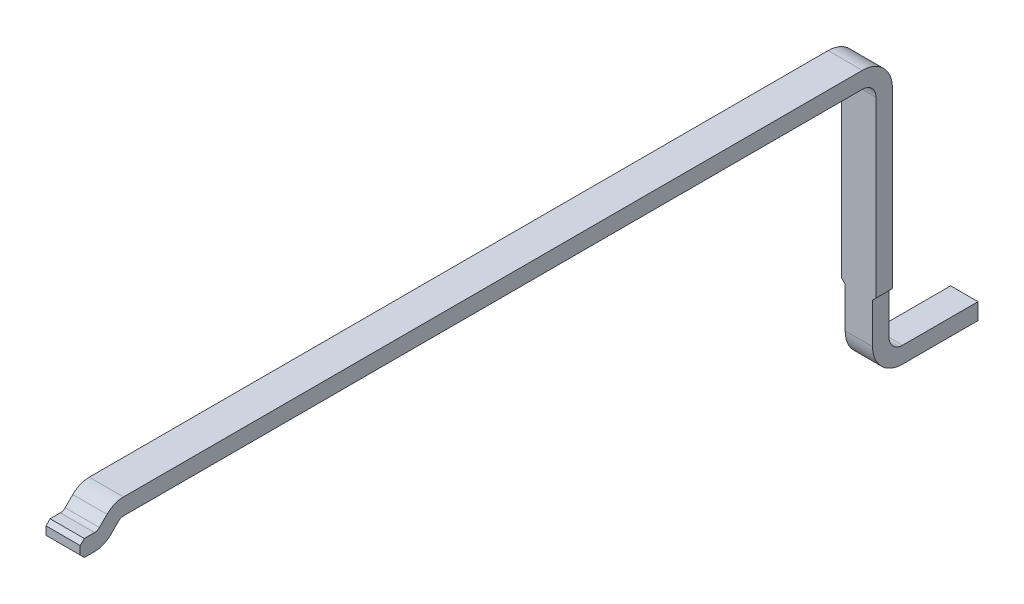
ISO-10303-21;
HEADER;
FILE_DESCRIPTION(('STEP AP214'),'2;1');
FILE_NAME('part.step','',(''),(''),'','','');
FILE_SCHEMA(('AUTOMOTIVE_DESIGN { 1 0 10303 214 1 1 1 1 }'));
ENDSEC;
DATA;
#1=APPLICATION_CONTEXT('core data for automotive mechanical design processes');
#2=APPLICATION_PROTOCOL_DEFINITION('international standard','automotive_design',2000,#1);
#3=PRODUCT_CONTEXT('',#1,'mechanical');
#4=PRODUCT('Part','Part','',(#3));
#5=PRODUCT_RELATED_PRODUCT_CATEGORY('part','',(#4));
#6=PRODUCT_DEFINITION_FORMATION('','',#4);
#7=PRODUCT_DEFINITION_CONTEXT('part definition',#1,'design');
#8=PRODUCT_DEFINITION('design','',#6,#7);
#9=PRODUCT_DEFINITION_SHAPE('','',#8);
#10=(LENGTH_UNIT() NAMED_UNIT(*) SI_UNIT(.MILLI.,.METRE.));
#11=(NAMED_UNIT(*) PLANE_ANGLE_UNIT() SI_UNIT($,.RADIAN.));
#12=(NAMED_UNIT(*) SI_UNIT($,.STERADIAN.) SOLID_ANGLE_UNIT());
#13=UNCERTAINTY_MEASURE_WITH_UNIT(LENGTH_MEASURE(1.E-05),#10,'distance_accuracy_value','');
#14=(GEOMETRIC_REPRESENTATION_CONTEXT(3) GLOBAL_UNCERTAINTY_ASSIGNED_CONTEXT((#13)) GLOBAL_UNIT_ASSIGNED_CONTEXT((#10,
#11,#12)) REPRESENTATION_CONTEXT('',''));
#15=CARTESIAN_POINT('',(0.,0.,0.));
#16=DIRECTION('',(0.,0.,1.));
#17=DIRECTION('',(1.,0.,0.));
#18=AXIS2_PLACEMENT_3D('',#15,#16,#17);
#19=CARTESIAN_POINT('',(12.5121082047,13.39951558355,-11.38169883308));
#20=DIRECTION('',(0.,1.,0.));
#21=DIRECTION('',(1.,0.,0.));
#22=AXIS2_PLACEMENT_3D('',#19,#20,#21);
#23=PLANE('',#22);
#24=DIRECTION('',(0.,0.,-1.));
#25=VECTOR('',#24,1.);
#26=CARTESIAN_POINT('',(16.41210823521,13.39951558355,-12.98169883308));
#27=LINE('',#26,#25);
#28=CARTESIAN_POINT('',(16.41210823521,13.39951558355,-5.777115138679));
#29=VERTEX_POINT('',#28);
#30=CARTESIAN_POINT('',(16.41210823521,13.39951558355,-11.17169883308));
#31=VERTEX_POINT('',#30);
#32=EDGE_CURVE('E243',#29,#31,#27,.T.);
#33=ORIENTED_EDGE('',*,*,#32,.F.);
#34=DIRECTION('',(1.,0.,0.));
#35=VECTOR('',#34,1.);
#36=CARTESIAN_POINT('',(12.5121082047,13.39951558355,-5.777115138679));
#37=LINE('',#36,#35);
#38=CARTESIAN_POINT('',(16.16210823521,13.39951558355,-5.777115138679));
#39=VERTEX_POINT('',#38);
#40=EDGE_CURVE('E386',#39,#29,#37,.T.);
#41=ORIENTED_EDGE('',*,*,#40,.F.);
#42=DIRECTION('',(0.,0.,1.));
#43=VECTOR('',#42,1.);
#44=CARTESIAN_POINT('',(16.16210823521,13.39951558355,-5.731698833076));
#45=LINE('',#44,#43);
#46=CARTESIAN_POINT('',(16.16210823521,13.39951558355,-11.17169883308));
#47=VERTEX_POINT('',#46);
#48=EDGE_CURVE('E233',#47,#39,#45,.T.);
#49=ORIENTED_EDGE('',*,*,#48,.F.);
#50=DIRECTION('',(1.,0.,0.));
#51=VECTOR('',#50,1.);
#52=CARTESIAN_POINT('',(13.11210817501,13.39951558355,-11.17169883308));
#53=LINE('',#52,#51);
#54=EDGE_CURVE('E391',#47,#31,#53,.T.);
#55=ORIENTED_EDGE('',*,*,#54,.T.);
#56=EDGE_LOOP('',(#33,#41,#49,#55));
#57=FACE_BOUND('',#56,.T.);
#58=ADVANCED_FACE('F17',(#57),#23,.F.);
#59=CARTESIAN_POINT('',(13.0621082047,13.51951558355,-7.369063364689));
#60=DIRECTION('',(0.,1.,0.));
#61=DIRECTION('',(1.,0.,0.));
#62=AXIS2_PLACEMENT_3D('',#59,#60,#61);
#63=PLANE('',#62);
#64=DIRECTION('',(-1.,0.,0.));
#65=VECTOR('',#64,1.);
#66=CARTESIAN_POINT('',(13.0621082047,13.51951558355,-11.17169883308));
#67=LINE('',#66,#65);
#68=CARTESIAN_POINT('',(16.41210823521,13.51951558355,-11.17169883308));
#69=VERTEX_POINT('',#68);
#70=CARTESIAN_POINT('',(16.16210823521,13.51951558355,-11.17169883308));
#71=VERTEX_POINT('',#70);
#72=EDGE_CURVE('E28',#69,#71,#67,.T.);
#73=ORIENTED_EDGE('',*,*,#72,.T.);
#74=DIRECTION('',(0.,0.,1.));
#75=VECTOR('',#74,1.);
#76=CARTESIAN_POINT('',(16.16210823521,13.51951558355,-7.369063364689));
#77=LINE('',#76,#75);
#78=CARTESIAN_POINT('',(16.16210823521,13.51951558355,-5.777115138679));
#79=VERTEX_POINT('',#78);
#80=EDGE_CURVE('E286',#71,#79,#77,.T.);
#81=ORIENTED_EDGE('',*,*,#80,.T.);
#82=DIRECTION('',(1.,0.,0.));
#83=VECTOR('',#82,1.);
#84=CARTESIAN_POINT('',(13.0621082047,13.51951558355,-5.777115138679));
#85=LINE('',#84,#83);
#86=CARTESIAN_POINT('',(16.41210823521,13.51951558355,-5.777115138679));
#87=VERTEX_POINT('',#86);
#88=EDGE_CURVE('E11',#79,#87,#85,.T.);
#89=ORIENTED_EDGE('',*,*,#88,.T.);
#90=DIRECTION('',(0.,0.,-1.));
#91=VECTOR('',#90,1.);
#92=CARTESIAN_POINT('',(16.41210823521,13.51951558355,-7.369063364689));
#93=LINE('',#92,#91);
#94=EDGE_CURVE('E417',#87,#69,#93,.T.);
#95=ORIENTED_EDGE('',*,*,#94,.T.);
#96=EDGE_LOOP('',(#73,#81,#89,#95));
#97=FACE_BOUND('',#96,.T.);
#98=ADVANCED_FACE('F672',(#97),#63,.T.);
#99=CARTESIAN_POINT('',(13.0621082047,13.34951558355,-5.777115138679));
#100=DIRECTION('',(-1.,0.,0.));
#101=DIRECTION('',(0.,0.,-1.));
#102=AXIS2_PLACEMENT_3D('',#99,#100,#101);
#103=CYLINDRICAL_SURFACE('',#102,0.17);
#104=ORIENTED_EDGE('',*,*,#88,.F.);
#105=CARTESIAN_POINT('',(16.16210823521,13.34951558355,-5.777115138679));
#106=DIRECTION('',(1.,0.,0.));
#107=DIRECTION('',(0.,0.,-1.));
#108=AXIS2_PLACEMENT_3D('',#105,#106,#107);
#109=CIRCLE('',#108,0.17);
#110=CARTESIAN_POINT('',(16.16210823521,13.469723736351,-5.656906985878));
#111=VERTEX_POINT('',#110);
#112=EDGE_CURVE('E282',#79,#111,#109,.T.);
#113=ORIENTED_EDGE('',*,*,#112,.T.);
#114=DIRECTION('',(1.,0.,0.));
#115=VECTOR('',#114,1.);
#116=CARTESIAN_POINT('',(13.0621082047,13.469723736351,-5.656906985877));
#117=LINE('',#116,#115);
#118=CARTESIAN_POINT('',(16.41210823521,13.469723736351,-5.656906985878));
#119=VERTEX_POINT('',#118);
#120=EDGE_CURVE('E344',#111,#119,#117,.T.);
#121=ORIENTED_EDGE('',*,*,#120,.T.);
#122=CARTESIAN_POINT('',(16.41210823521,13.34951558355,-5.777115138679));
#123=DIRECTION('',(1.,0.,0.));
#124=DIRECTION('',(0.,0.,-1.));
#125=AXIS2_PLACEMENT_3D('',#122,#123,#124);
#126=CIRCLE('',#125,0.17);
#127=EDGE_CURVE('E403',#87,#119,#126,.T.);
#128=ORIENTED_EDGE('',*,*,#127,.F.);
#129=EDGE_LOOP('',(#104,#113,#121,#128));
#130=FACE_BOUND('',#129,.T.);
#131=ADVANCED_FACE('F677',(#130),#103,.T.);
#132=CARTESIAN_POINT('',(13.1121082047,13.29951558355,-11.17169883308));
#133=DIRECTION('',(1.,0.,0.));
#134=DIRECTION('',(0.,0.,1.));
#135=AXIS2_PLACEMENT_3D('',#132,#133,#134);
#136=CYLINDRICAL_SURFACE('',#135,0.22);
#137=ORIENTED_EDGE('',*,*,#72,.F.);
#138=CARTESIAN_POINT('',(16.41210823521,13.29951558355,-11.17169883308));
#139=DIRECTION('',(-1.,0.,0.));
#140=DIRECTION('',(0.,0.,1.));
#141=AXIS2_PLACEMENT_3D('',#138,#139,#140);
#142=CIRCLE('',#141,0.22);
#143=CARTESIAN_POINT('',(16.41210823521,13.29951558355,-11.39169883308));
#144=VERTEX_POINT('',#143);
#145=EDGE_CURVE('E325',#69,#144,#142,.T.);
#146=ORIENTED_EDGE('',*,*,#145,.T.);
#147=DIRECTION('',(-1.,0.,0.));
#148=VECTOR('',#147,1.);
#149=CARTESIAN_POINT('',(13.1121082047,13.29951558355,-11.39169883308));
#150=LINE('',#149,#148);
#151=CARTESIAN_POINT('',(16.16210823521,13.29951558355,-11.39169883308));
#152=VERTEX_POINT('',#151);
#153=EDGE_CURVE('E291',#144,#152,#150,.T.);
#154=ORIENTED_EDGE('',*,*,#153,.T.);
#155=CARTESIAN_POINT('',(16.16210823521,13.29951558355,-11.17169883308));
#156=DIRECTION('',(1.,0.,0.));
#157=DIRECTION('',(0.,0.,1.));
#158=AXIS2_PLACEMENT_3D('',#155,#156,#157);
#159=CIRCLE('',#158,0.22);
#160=EDGE_CURVE('E326',#152,#71,#159,.T.);
#161=ORIENTED_EDGE('',*,*,#160,.T.);
#162=EDGE_LOOP('',(#137,#146,#154,#161));
#163=FACE_BOUND('',#162,.T.);
#164=ADVANCED_FACE('F646',(#163),#136,.T.);
#165=CARTESIAN_POINT('',(16.91210823377,13.39951558355,-5.586698833076));
#166=DIRECTION('',(0.,0.707106781186048,0.707106781187048));
#167=DIRECTION('',(1.,0.,0.));
#168=AXIS2_PLACEMENT_3D('',#165,#166,#167);
#169=PLANE('',#168);
#170=DIRECTION('',(1.,0.,0.));
#171=VECTOR('',#170,1.);
#172=CARTESIAN_POINT('',(16.91210823377,13.414160244491,-5.601343494016));
#173=LINE('',#172,#171);
#174=CARTESIAN_POINT('',(16.16210823521,13.41416024449,-5.601343494017));
#175=VERTEX_POINT('',#174);
#176=CARTESIAN_POINT('',(16.41210823521,13.41416024449,-5.601343494017));
#177=VERTEX_POINT('',#176);
#178=EDGE_CURVE('E341',#175,#177,#173,.T.);
#179=ORIENTED_EDGE('',*,*,#178,.T.);
#180=DIRECTION('',(0.,-0.707106781180048,0.707106781193047));
#181=VECTOR('',#180,1.);
#182=CARTESIAN_POINT('',(16.41210823521,13.46972373635,-5.656906985878));
#183=LINE('',#182,#181);
#184=EDGE_CURVE('E334',#119,#177,#183,.T.);
#185=ORIENTED_EDGE('',*,*,#184,.F.);
#186=ORIENTED_EDGE('',*,*,#120,.F.);
#187=DIRECTION('',(0.,-0.707106781180048,0.707106781193047));
#188=VECTOR('',#187,1.);
#189=CARTESIAN_POINT('',(16.16210823521,13.46972373635,-5.656906985878));
#190=LINE('',#189,#188);
#191=EDGE_CURVE('E287',#111,#175,#190,.T.);
#192=ORIENTED_EDGE('',*,*,#191,.T.);
#193=EDGE_LOOP('',(#179,#185,#186,#192));
#194=FACE_BOUND('',#193,.T.);
#195=ADVANCED_FACE('F640',(#194),#169,.T.);
#196=CARTESIAN_POINT('',(16.91210823377,13.44951558355,-5.565988154957));
#197=DIRECTION('',(-1.,0.,0.));
#198=DIRECTION('',(0.,0.,-1.));
#199=AXIS2_PLACEMENT_3D('',#196,#197,#198);
#200=CYLINDRICAL_SURFACE('',#199,0.05);
#201=DIRECTION('',(1.,0.,0.));
#202=VECTOR('',#201,1.);
#203=CARTESIAN_POINT('',(17.56534248199,13.39951558355,-5.565988154957));
#204=LINE('',#203,#202);
#205=CARTESIAN_POINT('',(16.16210823521,13.39951558355,-5.565988154957));
#206=VERTEX_POINT('',#205);
#207=CARTESIAN_POINT('',(16.41210823521,13.39951558355,-5.565988154957));
#208=VERTEX_POINT('',#207);
#209=EDGE_CURVE('E266',#206,#208,#204,.T.);
#210=ORIENTED_EDGE('',*,*,#209,.T.);
#211=CARTESIAN_POINT('',(16.41210823521,13.44951558355,-5.565988154957));
#212=DIRECTION('',(-1.,0.,0.));
#213=DIRECTION('',(0.,0.,-1.));
#214=AXIS2_PLACEMENT_3D('',#211,#212,#213);
#215=CIRCLE('',#214,0.05);
#216=EDGE_CURVE('E319',#177,#208,#215,.T.);
#217=ORIENTED_EDGE('',*,*,#216,.F.);
#218=ORIENTED_EDGE('',*,*,#178,.F.);
#219=CARTESIAN_POINT('',(16.16210823521,13.44951558355,-5.565988154957));
#220=DIRECTION('',(-1.,0.,0.));
#221=DIRECTION('',(0.,0.,-1.));
#222=AXIS2_PLACEMENT_3D('',#219,#220,#221);
#223=CIRCLE('',#222,0.05);
#224=EDGE_CURVE('E358',#175,#206,#223,.T.);
#225=ORIENTED_EDGE('',*,*,#224,.T.);
#226=EDGE_LOOP('',(#210,#217,#218,#225));
#227=FACE_BOUND('',#226,.T.);
#228=ADVANCED_FACE('F645',(#227),#200,.F.);
#229=CARTESIAN_POINT('',(17.56534248199,13.39951558355,-5.535988154957));
#230=DIRECTION('',(0.,-1.,-1.402976681707E-13));
#231=DIRECTION('',(0.,1.402976681707E-13,-1.));
#232=AXIS2_PLACEMENT_3D('',#229,#230,#231);
#233=PLANE('',#232);
#234=DIRECTION('',(0.,0.,1.));
#235=VECTOR('',#234,1.);
#236=CARTESIAN_POINT('',(16.41210823521,13.39951558355,-12.98169883308));
#237=LINE('',#236,#235);
#238=CARTESIAN_POINT('',(16.41210823521,13.39951558355,-5.491404460561));
#239=VERTEX_POINT('',#238);
#240=EDGE_CURVE('E316',#208,#239,#237,.T.);
#241=ORIENTED_EDGE('',*,*,#240,.F.);
#242=ORIENTED_EDGE('',*,*,#209,.F.);
#243=DIRECTION('',(0.,0.,1.));
#244=VECTOR('',#243,1.);
#245=CARTESIAN_POINT('',(16.16210823521,13.39951558355,-5.731698833076));
#246=LINE('',#245,#244);
#247=CARTESIAN_POINT('',(16.16210823521,13.39951558355,-5.491404460561));
#248=VERTEX_POINT('',#247);
#249=EDGE_CURVE('E361',#206,#248,#246,.T.);
#250=ORIENTED_EDGE('',*,*,#249,.T.);
#251=DIRECTION('',(-1.,0.,0.));
#252=VECTOR('',#251,1.);
#253=CARTESIAN_POINT('',(16.91210823377,13.39951558355,-5.491404460561));
#254=LINE('',#253,#252);
#255=EDGE_CURVE('E513',#239,#248,#254,.T.);
#256=ORIENTED_EDGE('',*,*,#255,.F.);
#257=EDGE_LOOP('',(#241,#242,#250,#256));
#258=FACE_BOUND('',#257,.T.);
#259=ADVANCED_FACE('F700',(#258),#233,.F.);
#260=CARTESIAN_POINT('',(16.91210823377,13.36951558355,-5.461404460561));
#261=DIRECTION('',(0.,0.707106781186048,0.707106781187048));
#262=DIRECTION('',(1.,0.,0.));
#263=AXIS2_PLACEMENT_3D('',#260,#261,#262);
#264=PLANE('',#263);
#265=DIRECTION('',(-1.,0.,0.));
#266=VECTOR('',#265,1.);
#267=CARTESIAN_POINT('',(16.91210823377,13.36951558355,-5.461404460561));
#268=LINE('',#267,#266);
#269=CARTESIAN_POINT('',(16.41210823521,13.36951558355,-5.461404460561));
#270=VERTEX_POINT('',#269);
#271=CARTESIAN_POINT('',(16.16210823521,13.36951558355,-5.461404460561));
#272=VERTEX_POINT('',#271);
#273=EDGE_CURVE('E492',#270,#272,#268,.T.);
#274=ORIENTED_EDGE('',*,*,#273,.F.);
#275=DIRECTION('',(0.,-0.707106781186548,0.707106781186548));
#276=VECTOR('',#275,1.);
#277=CARTESIAN_POINT('',(16.41210823521,13.39951558355,-5.491404460561));
#278=LINE('',#277,#276);
#279=EDGE_CURVE('E302',#239,#270,#278,.T.);
#280=ORIENTED_EDGE('',*,*,#279,.F.);
#281=ORIENTED_EDGE('',*,*,#255,.T.);
#282=DIRECTION('',(0.,-0.707106781186548,0.707106781186548));
#283=VECTOR('',#282,1.);
#284=CARTESIAN_POINT('',(16.16210823521,13.39951558355,-5.491404460561));
#285=LINE('',#284,#283);
#286=EDGE_CURVE('E280',#248,#272,#285,.T.);
#287=ORIENTED_EDGE('',*,*,#286,.T.);
#288=EDGE_LOOP('',(#274,#280,#281,#287));
#289=FACE_BOUND('',#288,.T.);
#290=ADVANCED_FACE('F695',(#289),#264,.T.);
#291=CARTESIAN_POINT('',(16.91210823377,13.27951558355,-5.461404460561));
#292=DIRECTION('',(0.,0.,1.));
#293=DIRECTION('',(1.,0.,0.));
#294=AXIS2_PLACEMENT_3D('',#291,#292,#293);
#295=PLANE('',#294);
#296=DIRECTION('',(1.,0.,0.));
#297=VECTOR('',#296,1.);
#298=CARTESIAN_POINT('',(16.91210823377,13.30951558355,-5.461404460561));
#299=LINE('',#298,#297);
#300=CARTESIAN_POINT('',(16.16210823521,13.30951558355,-5.461404460561));
#301=VERTEX_POINT('',#300);
#302=CARTESIAN_POINT('',(16.41210823521,13.30951558355,-5.461404460561));
#303=VERTEX_POINT('',#302);
#304=EDGE_CURVE('E237',#301,#303,#299,.T.);
#305=ORIENTED_EDGE('',*,*,#304,.T.);
#306=DIRECTION('',(0.,-1.,0.));
#307=VECTOR('',#306,1.);
#308=CARTESIAN_POINT('',(16.41210823521,13.67951558355,-5.461404460561));
#309=LINE('',#308,#307);
#310=EDGE_CURVE('E297',#270,#303,#309,.T.);
#311=ORIENTED_EDGE('',*,*,#310,.F.);
#312=ORIENTED_EDGE('',*,*,#273,.T.);
#313=DIRECTION('',(0.,-1.,0.));
#314=VECTOR('',#313,1.);
#315=CARTESIAN_POINT('',(16.16210823521,13.39951558355,-5.461404460561));
#316=LINE('',#315,#314);
#317=EDGE_CURVE('E276',#272,#301,#316,.T.);
#318=ORIENTED_EDGE('',*,*,#317,.T.);
#319=EDGE_LOOP('',(#305,#311,#312,#318));
#320=FACE_BOUND('',#319,.T.);
#321=ADVANCED_FACE('F486',(#320),#295,.T.);
#322=CARTESIAN_POINT('',(16.91210823377,13.27951558355,-5.491404460561));
#323=DIRECTION('',(0.,0.707106781186548,-0.707106781186548));
#324=DIRECTION('',(-1.,0.,0.));
#325=AXIS2_PLACEMENT_3D('',#322,#323,#324);
#326=PLANE('',#325);
#327=DIRECTION('',(-1.,0.,0.));
#328=VECTOR('',#327,1.);
#329=CARTESIAN_POINT('',(16.91210823377,13.27951558355,-5.491404460561));
#330=LINE('',#329,#328);
#331=CARTESIAN_POINT('',(16.41210823521,13.27951558355,-5.491404460561));
#332=VERTEX_POINT('',#331);
#333=CARTESIAN_POINT('',(16.16210823521,13.27951558355,-5.491404460561));
#334=VERTEX_POINT('',#333);
#335=EDGE_CURVE('E234',#332,#334,#330,.T.);
#336=ORIENTED_EDGE('',*,*,#335,.F.);
#337=DIRECTION('',(0.,-0.707106781186548,-0.707106781186548));
#338=VECTOR('',#337,1.);
#339=CARTESIAN_POINT('',(16.41210823521,13.30951558355,-5.461404460561));
#340=LINE('',#339,#338);
#341=EDGE_CURVE('E301',#303,#332,#340,.T.);
#342=ORIENTED_EDGE('',*,*,#341,.F.);
#343=ORIENTED_EDGE('',*,*,#304,.F.);
#344=DIRECTION('',(0.,-0.707106781186548,-0.707106781186548));
#345=VECTOR('',#344,1.);
#346=CARTESIAN_POINT('',(16.16210823521,13.30951558355,-5.461404460561));
#347=LINE('',#346,#345);
#348=EDGE_CURVE('E281',#301,#334,#347,.T.);
#349=ORIENTED_EDGE('',*,*,#348,.T.);
#350=EDGE_LOOP('',(#336,#342,#343,#349));
#351=FACE_BOUND('',#350,.T.);
#352=ADVANCED_FACE('F494',(#351),#326,.F.);
#353=CARTESIAN_POINT('',(16.91210823377,13.27951558355,-5.661404460561));
#354=DIRECTION('',(0.,-1.,0.));
#355=DIRECTION('',(0.,0.,-1.));
#356=AXIS2_PLACEMENT_3D('',#353,#354,#355);
#357=PLANE('',#356);
#358=ORIENTED_EDGE('',*,*,#335,.T.);
#359=DIRECTION('',(0.,0.,-1.));
#360=VECTOR('',#359,1.);
#361=CARTESIAN_POINT('',(16.16210823521,13.27951558355,-5.731698833076));
#362=LINE('',#361,#360);
#363=CARTESIAN_POINT('',(16.16210823521,13.27951558355,-5.565988154957));
#364=VERTEX_POINT('',#363);
#365=EDGE_CURVE('E315',#334,#364,#362,.T.);
#366=ORIENTED_EDGE('',*,*,#365,.T.);
#367=DIRECTION('',(-1.,0.,0.));
#368=VECTOR('',#367,1.);
#369=CARTESIAN_POINT('',(16.91210823377,13.27951558355,-5.565988154957));
#370=LINE('',#369,#368);
#371=CARTESIAN_POINT('',(16.41210823521,13.27951558355,-5.565988154957));
#372=VERTEX_POINT('',#371);
#373=EDGE_CURVE('E238',#372,#364,#370,.T.);
#374=ORIENTED_EDGE('',*,*,#373,.F.);
#375=DIRECTION('',(0.,0.,-1.));
#376=VECTOR('',#375,1.);
#377=CARTESIAN_POINT('',(16.41210823521,13.27951558355,-12.98169883308));
#378=LINE('',#377,#376);
#379=EDGE_CURVE('E340',#332,#372,#378,.T.);
#380=ORIENTED_EDGE('',*,*,#379,.F.);
#381=EDGE_LOOP('',(#358,#366,#374,#380));
#382=FACE_BOUND('',#381,.T.);
#383=ADVANCED_FACE('F634',(#382),#357,.T.);
#384=CARTESIAN_POINT('',(16.91210823377,13.44951558355,-5.565988154957));
#385=DIRECTION('',(1.,0.,0.));
#386=DIRECTION('',(0.,0.,1.));
#387=AXIS2_PLACEMENT_3D('',#384,#385,#386);
#388=CYLINDRICAL_SURFACE('',#387,0.17);
#389=DIRECTION('',(-1.,0.,0.));
#390=VECTOR('',#389,1.);
#391=CARTESIAN_POINT('',(16.91210823377,13.329307430749,-5.68619630776));
#392=LINE('',#391,#390);
#393=CARTESIAN_POINT('',(16.41210823521,13.329307430749,-5.686196307759));
#394=VERTEX_POINT('',#393);
#395=CARTESIAN_POINT('',(16.16210823521,13.329307430749,-5.686196307759));
#396=VERTEX_POINT('',#395);
#397=EDGE_CURVE('E395',#394,#396,#392,.T.);
#398=ORIENTED_EDGE('',*,*,#397,.F.);
#399=CARTESIAN_POINT('',(16.41210823521,13.44951558355,-5.565988154957));
#400=DIRECTION('',(1.,0.,0.));
#401=DIRECTION('',(0.,0.,1.));
#402=AXIS2_PLACEMENT_3D('',#399,#400,#401);
#403=CIRCLE('',#402,0.17);
#404=EDGE_CURVE('E335',#372,#394,#403,.T.);
#405=ORIENTED_EDGE('',*,*,#404,.F.);
#406=ORIENTED_EDGE('',*,*,#373,.T.);
#407=CARTESIAN_POINT('',(16.16210823521,13.44951558355,-5.565988154957));
#408=DIRECTION('',(1.,0.,0.));
#409=DIRECTION('',(0.,0.,1.));
#410=AXIS2_PLACEMENT_3D('',#407,#408,#409);
#411=CIRCLE('',#410,0.17);
#412=EDGE_CURVE('E411',#364,#396,#411,.T.);
#413=ORIENTED_EDGE('',*,*,#412,.T.);
#414=EDGE_LOOP('',(#398,#405,#406,#413));
#415=FACE_BOUND('',#414,.T.);
#416=ADVANCED_FACE('F733',(#415),#388,.T.);
#417=CARTESIAN_POINT('',(16.91210823377,13.39951558355,-5.756404460561));
#418=DIRECTION('',(0.,-0.707106781187048,-0.707106781186048));
#419=DIRECTION('',(0.,0.707106781186048,-0.707106781187048));
#420=AXIS2_PLACEMENT_3D('',#417,#418,#419);
#421=PLANE('',#420);
#422=DIRECTION('',(1.,0.,0.));
#423=VECTOR('',#422,1.);
#424=CARTESIAN_POINT('',(12.5121082047,13.38487092261,-5.74175979962));
#425=LINE('',#424,#423);
#426=CARTESIAN_POINT('',(16.16210823521,13.38487092261,-5.74175979962));
#427=VERTEX_POINT('',#426);
#428=CARTESIAN_POINT('',(16.41210823521,13.38487092261,-5.74175979962));
#429=VERTEX_POINT('',#428);
#430=EDGE_CURVE('E390',#427,#429,#425,.T.);
#431=ORIENTED_EDGE('',*,*,#430,.T.);
#432=DIRECTION('',(0.,0.707106781180048,-0.707106781193047));
#433=VECTOR('',#432,1.);
#434=CARTESIAN_POINT('',(16.41210823521,13.32930743075,-5.686196307759));
#435=LINE('',#434,#433);
#436=EDGE_CURVE('E339',#394,#429,#435,.T.);
#437=ORIENTED_EDGE('',*,*,#436,.F.);
#438=ORIENTED_EDGE('',*,*,#397,.T.);
#439=DIRECTION('',(0.,0.707106781180048,-0.707106781193047));
#440=VECTOR('',#439,1.);
#441=CARTESIAN_POINT('',(16.16210823521,13.32930743075,-5.686196307759));
#442=LINE('',#441,#440);
#443=EDGE_CURVE('E232',#396,#427,#442,.T.);
#444=ORIENTED_EDGE('',*,*,#443,.T.);
#445=EDGE_LOOP('',(#431,#437,#438,#444));
#446=FACE_BOUND('',#445,.T.);
#447=ADVANCED_FACE('F666',(#446),#421,.T.);
#448=CARTESIAN_POINT('',(12.5121082047,13.34951558355,-5.777115138679));
#449=DIRECTION('',(1.,0.,0.));
#450=DIRECTION('',(0.,0.,1.));
#451=AXIS2_PLACEMENT_3D('',#448,#449,#450);
#452=CYLINDRICAL_SURFACE('',#451,0.05);
#453=ORIENTED_EDGE('',*,*,#40,.T.);
#454=CARTESIAN_POINT('',(16.41210823521,13.34951558355,-5.777115138679));
#455=DIRECTION('',(-1.,0.,0.));
#456=DIRECTION('',(0.,0.,1.));
#457=AXIS2_PLACEMENT_3D('',#454,#455,#456);
#458=CIRCLE('',#457,0.05);
#459=EDGE_CURVE('E405',#429,#29,#458,.T.);
#460=ORIENTED_EDGE('',*,*,#459,.F.);
#461=ORIENTED_EDGE('',*,*,#430,.F.);
#462=CARTESIAN_POINT('',(16.16210823521,13.34951558355,-5.777115138679));
#463=DIRECTION('',(-1.,0.,0.));
#464=DIRECTION('',(0.,0.,1.));
#465=AXIS2_PLACEMENT_3D('',#462,#463,#464);
#466=CIRCLE('',#465,0.05);
#467=EDGE_CURVE('E228',#427,#39,#466,.T.);
#468=ORIENTED_EDGE('',*,*,#467,.T.);
#469=EDGE_LOOP('',(#453,#460,#461,#468));
#470=FACE_BOUND('',#469,.T.);
#471=ADVANCED_FACE('F574',(#470),#452,.F.);
#472=CARTESIAN_POINT('',(12.5121082047,13.29951558355,-11.17169883308));
#473=DIRECTION('',(-1.,0.,0.));
#474=DIRECTION('',(0.,0.,-1.));
#475=AXIS2_PLACEMENT_3D('',#472,#473,#474);
#476=CYLINDRICAL_SURFACE('',#475,0.1);
#477=CARTESIAN_POINT('',(16.16210823521,13.29951558355,-11.17169883308));
#478=DIRECTION('',(1.,0.,0.));
#479=DIRECTION('',(0.,0.,-1.));
#480=AXIS2_PLACEMENT_3D('',#477,#478,#479);
#481=CIRCLE('',#480,0.1);
#482=CARTESIAN_POINT('',(16.16210823521,13.29951558355,-11.27169883308));
#483=VERTEX_POINT('',#482);
#484=EDGE_CURVE('E305',#483,#47,#481,.T.);
#485=ORIENTED_EDGE('',*,*,#484,.F.);
#486=DIRECTION('',(-1.,0.,0.));
#487=VECTOR('',#486,1.);
#488=CARTESIAN_POINT('',(12.5121082047,13.29951558355,-11.27169883308));
#489=LINE('',#488,#487);
#490=CARTESIAN_POINT('',(16.41210823521,13.29951558355,-11.27169883308));
#491=VERTEX_POINT('',#490);
#492=EDGE_CURVE('E290',#491,#483,#489,.T.);
#493=ORIENTED_EDGE('',*,*,#492,.F.);
#494=CARTESIAN_POINT('',(16.41210823521,13.29951558355,-11.17169883308));
#495=DIRECTION('',(-1.,0.,0.));
#496=DIRECTION('',(0.,0.,-1.));
#497=AXIS2_PLACEMENT_3D('',#494,#495,#496);
#498=CIRCLE('',#497,0.1);
#499=EDGE_CURVE('E239',#31,#491,#498,.T.);
#500=ORIENTED_EDGE('',*,*,#499,.F.);
#501=ORIENTED_EDGE('',*,*,#54,.F.);
#502=EDGE_LOOP('',(#485,#493,#500,#501));
#503=FACE_BOUND('',#502,.T.);
#504=ADVANCED_FACE('F584',(#503),#476,.F.);
#505=CARTESIAN_POINT('',(13.1121082047,11.34951558355,-11.27169883308));
#506=DIRECTION('',(0.,0.,1.));
#507=DIRECTION('',(1.,0.,0.));
#508=AXIS2_PLACEMENT_3D('',#505,#506,#507);
#509=PLANE('',#508);
#510=DIRECTION('',(0.,1.,0.));
#511=VECTOR('',#510,1.);
#512=CARTESIAN_POINT('',(16.38710821514,11.34951558355,-11.27169883308));
#513=LINE('',#512,#511);
#514=CARTESIAN_POINT('',(16.3871082249766,11.70951558355,-11.27169883308));
#515=VERTEX_POINT('',#514);
#516=CARTESIAN_POINT('',(16.387108220344,12.0045155708012,-11.27169883308));
#517=VERTEX_POINT('',#516);
#518=EDGE_CURVE('E522',#515,#517,#513,.T.);
#519=ORIENTED_EDGE('',*,*,#518,.T.);
#520=DIRECTION('',(0.707106781187048,0.707106781186048,0.));
#521=VECTOR('',#520,1.);
#522=CARTESIAN_POINT('',(16.38210823521,11.99951558355,-11.27169883308));
#523=LINE('',#522,#521);
#524=CARTESIAN_POINT('',(16.41210823521,12.02951558355,-11.27169883308));
#525=VERTEX_POINT('',#524);
#526=EDGE_CURVE('E42',#517,#525,#523,.T.);
#527=ORIENTED_EDGE('',*,*,#526,.T.);
#528=DIRECTION('',(0.,-1.,0.));
#529=VECTOR('',#528,1.);
#530=CARTESIAN_POINT('',(16.41210823521,13.67951558355,-11.27169883308));
#531=LINE('',#530,#529);
#532=EDGE_CURVE('E242',#491,#525,#531,.T.);
#533=ORIENTED_EDGE('',*,*,#532,.F.);
#534=ORIENTED_EDGE('',*,*,#492,.T.);
#535=DIRECTION('',(0.,-1.,0.));
#536=VECTOR('',#535,1.);
#537=CARTESIAN_POINT('',(16.16210823521,13.39951558355,-11.27169883308));
#538=LINE('',#537,#536);
#539=CARTESIAN_POINT('',(16.16210823521,12.02951558355,-11.27169883308));
#540=VERTEX_POINT('',#539);
#541=EDGE_CURVE('E254',#483,#540,#538,.T.);
#542=ORIENTED_EDGE('',*,*,#541,.T.);
#543=DIRECTION('',(0.707106497353991,-0.707107065018991,0.));
#544=VECTOR('',#543,1.);
#545=CARTESIAN_POINT('',(16.16210823521,12.02951558355,-11.27169883308));
#546=LINE('',#545,#544);
#547=CARTESIAN_POINT('',(16.1871082169925,12.0045155917334,-11.27169883308));
#548=VERTEX_POINT('',#547);
#549=EDGE_CURVE('E275',#540,#548,#546,.T.);
#550=ORIENTED_EDGE('',*,*,#549,.T.);
#551=DIRECTION('',(0.,-1.,0.));
#552=VECTOR('',#551,1.);
#553=CARTESIAN_POINT('',(16.18710821514,11.34951558355,-11.27169883308));
#554=LINE('',#553,#552);
#555=CARTESIAN_POINT('',(16.1871082146639,11.70951558355,-11.27169883308));
#556=VERTEX_POINT('',#555);
#557=EDGE_CURVE('E295',#548,#556,#554,.T.);
#558=ORIENTED_EDGE('',*,*,#557,.T.);
#559=DIRECTION('',(1.,0.,0.));
#560=VECTOR('',#559,1.);
#561=CARTESIAN_POINT('',(13.1121082047,11.70951558355,-11.27169883308));
#562=LINE('',#561,#560);
#563=EDGE_CURVE('E311',#556,#515,#562,.T.);
#564=ORIENTED_EDGE('',*,*,#563,.T.);
#565=EDGE_LOOP('',(#519,#527,#533,#534,#542,#550,#558,#564));
#566=FACE_BOUND('',#565,.T.);
#567=ADVANCED_FACE('F586',(#566),#509,.T.);
#568=CARTESIAN_POINT('',(16.38210823521,11.99951558355,-7.369063364689));
#569=DIRECTION('',(-0.707106781186048,0.707106781187048,0.));
#570=DIRECTION('',(0.,0.,1.));
#571=AXIS2_PLACEMENT_3D('',#568,#569,#570);
#572=PLANE('',#571);
#573=DIRECTION('',(0.707107065018991,0.707106497353991,0.));
#574=VECTOR('',#573,1.);
#575=CARTESIAN_POINT('',(16.38710821514,12.00451558355,-11.39169883308));
#576=LINE('',#575,#574);
#577=CARTESIAN_POINT('',(16.3871082169925,12.0045155753666,-11.39169883308));
#578=VERTEX_POINT('',#577);
#579=CARTESIAN_POINT('',(16.41210823521,12.02951558355,-11.39169883308));
#580=VERTEX_POINT('',#579);
#581=EDGE_CURVE('E357',#578,#580,#576,.T.);
#582=ORIENTED_EDGE('',*,*,#581,.T.);
#583=DIRECTION('',(0.,0.,-1.));
#584=VECTOR('',#583,1.);
#585=CARTESIAN_POINT('',(16.41210823521,12.02951558355,-12.98169883308));
#586=LINE('',#585,#584);
#587=EDGE_CURVE('E252',#525,#580,#586,.T.);
#588=ORIENTED_EDGE('',*,*,#587,.F.);
#589=ORIENTED_EDGE('',*,*,#526,.F.);
#590=DIRECTION('',(0.,0.,1.));
#591=VECTOR('',#590,1.);
#592=CARTESIAN_POINT('',(16.387108225175,12.004515573515,-7.369063364689));
#593=LINE('',#592,#591);
#594=EDGE_CURVE('E346',#578,#517,#593,.T.);
#595=ORIENTED_EDGE('',*,*,#594,.F.);
#596=EDGE_LOOP('',(#582,#588,#589,#595));
#597=FACE_BOUND('',#596,.T.);
#598=ADVANCED_FACE('F725',(#597),#572,.F.);
#599=CARTESIAN_POINT('',(13.1121082047,13.51951558355,-11.39169883308));
#600=DIRECTION('',(0.,0.,1.));
#601=DIRECTION('',(1.,0.,0.));
#602=AXIS2_PLACEMENT_3D('',#599,#600,#601);
#603=PLANE('',#602);
#604=DIRECTION('',(0.,1.,0.));
#605=VECTOR('',#604,1.);
#606=CARTESIAN_POINT('',(16.41210823521,13.67951558355,-11.39169883308));
#607=LINE('',#606,#605);
#608=EDGE_CURVE('E321',#580,#144,#607,.T.);
#609=ORIENTED_EDGE('',*,*,#608,.F.);
#610=ORIENTED_EDGE('',*,*,#581,.F.);
#611=DIRECTION('',(0.,1.,0.));
#612=VECTOR('',#611,1.);
#613=CARTESIAN_POINT('',(16.38710821514,13.51951558355,-11.39169883308));
#614=LINE('',#613,#612);
#615=CARTESIAN_POINT('',(16.3871082047552,11.70951558355,-11.39169883308));
#616=VERTEX_POINT('',#615);
#617=EDGE_CURVE('E21',#616,#578,#614,.T.);
#618=ORIENTED_EDGE('',*,*,#617,.F.);
#619=DIRECTION('',(1.,0.,0.));
#620=VECTOR('',#619,1.);
#621=CARTESIAN_POINT('',(13.1121082047,11.70951558355,-11.39169883308));
#622=LINE('',#621,#620);
#623=CARTESIAN_POINT('',(16.1871082146639,11.70951558355,-11.39169883308));
#624=VERTEX_POINT('',#623);
#625=EDGE_CURVE('E194',#624,#616,#622,.T.);
#626=ORIENTED_EDGE('',*,*,#625,.F.);
#627=DIRECTION('',(0.,-1.,0.));
#628=VECTOR('',#627,1.);
#629=CARTESIAN_POINT('',(16.18710821514,13.51951558355,-11.39169883308));
#630=LINE('',#629,#628);
#631=CARTESIAN_POINT('',(16.1871082169925,12.0045155917334,-11.39169883308));
#632=VERTEX_POINT('',#631);
#633=EDGE_CURVE('E292',#632,#624,#630,.T.);
#634=ORIENTED_EDGE('',*,*,#633,.F.);
#635=DIRECTION('',(0.707106497353991,-0.707107065018991,0.));
#636=VECTOR('',#635,1.);
#637=CARTESIAN_POINT('',(16.16210823521,12.02951558355,-11.39169883308));
#638=LINE('',#637,#636);
#639=CARTESIAN_POINT('',(16.16210823521,12.02951558355,-11.39169883308));
#640=VERTEX_POINT('',#639);
#641=EDGE_CURVE('E271',#640,#632,#638,.T.);
#642=ORIENTED_EDGE('',*,*,#641,.F.);
#643=DIRECTION('',(0.,1.,0.));
#644=VECTOR('',#643,1.);
#645=CARTESIAN_POINT('',(16.16210823521,13.39951558355,-11.39169883308));
#646=LINE('',#645,#644);
#647=EDGE_CURVE('E330',#640,#152,#646,.T.);
#648=ORIENTED_EDGE('',*,*,#647,.T.);
#649=ORIENTED_EDGE('',*,*,#153,.F.);
#650=EDGE_LOOP('',(#609,#610,#618,#626,#634,#642,#648,#649));
#651=FACE_BOUND('',#650,.T.);
#652=ADVANCED_FACE('F437',(#651),#603,.F.);
#653=CARTESIAN_POINT('',(16.16210823521,12.02951558355,-5.731698833076));
#654=DIRECTION('',(0.707106781187048,0.707106781186048,0.));
#655=DIRECTION('',(0.,0.,-1.));
#656=AXIS2_PLACEMENT_3D('',#653,#654,#655);
#657=PLANE('',#656);
#658=ORIENTED_EDGE('',*,*,#641,.T.);
#659=DIRECTION('',(0.,0.,-1.));
#660=VECTOR('',#659,1.);
#661=CARTESIAN_POINT('',(16.187108225175,12.004515593585,-5.731698833076));
#662=LINE('',#661,#660);
#663=EDGE_CURVE('E296',#548,#632,#662,.T.);
#664=ORIENTED_EDGE('',*,*,#663,.F.);
#665=ORIENTED_EDGE('',*,*,#549,.F.);
#666=DIRECTION('',(0.,0.,-1.));
#667=VECTOR('',#666,1.);
#668=CARTESIAN_POINT('',(16.16210823521,12.02951558355,-5.731698833076));
#669=LINE('',#668,#667);
#670=EDGE_CURVE('E262',#540,#640,#669,.T.);
#671=ORIENTED_EDGE('',*,*,#670,.T.);
#672=EDGE_LOOP('',(#658,#664,#665,#671));
#673=FACE_BOUND('',#672,.T.);
#674=ADVANCED_FACE('F426',(#673),#657,.F.);
#675=CARTESIAN_POINT('',(16.38710817501,11.72951558355,-13.03169883308));
#676=DIRECTION('',(1.,0.,0.));
#677=DIRECTION('',(0.,0.,-1.));
#678=AXIS2_PLACEMENT_3D('',#675,#676,#677);
#679=PLANE('',#678);
#680=ORIENTED_EDGE('',*,*,#594,.T.);
#681=ORIENTED_EDGE('',*,*,#518,.F.);
#682=CARTESIAN_POINT('',(16.38710823521,11.70951558355,-11.49169883308));
#683=DIRECTION('',(1.,0.,0.));
#684=DIRECTION('',(0.,0.,-1.));
#685=AXIS2_PLACEMENT_3D('',#682,#683,#684);
#686=CIRCLE('',#685,0.22);
#687=CARTESIAN_POINT('',(16.3871082047601,11.48951558355,-11.49169883308));
#688=VERTEX_POINT('',#687);
#689=EDGE_CURVE('E198',#515,#688,#686,.T.);
#690=ORIENTED_EDGE('',*,*,#689,.T.);
#691=DIRECTION('',(0.,0.,-1.));
#692=VECTOR('',#691,1.);
#693=CARTESIAN_POINT('',(16.38710817501,11.48951558355,-13.03169883308));
#694=LINE('',#693,#692);
#695=CARTESIAN_POINT('',(16.38710817501,11.48951558355,-12.04169883308));
#696=VERTEX_POINT('',#695);
#697=EDGE_CURVE('E348',#688,#696,#694,.T.);
#698=ORIENTED_EDGE('',*,*,#697,.T.);
#699=DIRECTION('',(0.,1.,0.));
#700=VECTOR('',#699,1.);
#701=CARTESIAN_POINT('',(16.38710817501,11.72951558355,-12.04169883308));
#702=LINE('',#701,#700);
#703=CARTESIAN_POINT('',(16.38710817501,11.60951558355,-12.04169883308));
#704=VERTEX_POINT('',#703);
#705=EDGE_CURVE('E206',#696,#704,#702,.T.);
#706=ORIENTED_EDGE('',*,*,#705,.T.);
#707=DIRECTION('',(0.,0.,1.));
#708=VECTOR('',#707,1.);
#709=CARTESIAN_POINT('',(16.38710817501,11.60951558355,-13.03169883308));
#710=LINE('',#709,#708);
#711=CARTESIAN_POINT('',(16.3871081847419,11.60951558355,-11.49169883308));
#712=VERTEX_POINT('',#711);
#713=EDGE_CURVE('E201',#704,#712,#710,.T.);
#714=ORIENTED_EDGE('',*,*,#713,.T.);
#715=CARTESIAN_POINT('',(16.38710819507,11.70951558355,-11.49169883308));
#716=DIRECTION('',(-1.,0.,0.));
#717=DIRECTION('',(0.,0.,1.));
#718=AXIS2_PLACEMENT_3D('',#715,#716,#717);
#719=CIRCLE('',#718,0.1);
#720=EDGE_CURVE('E186',#712,#616,#719,.T.);
#721=ORIENTED_EDGE('',*,*,#720,.T.);
#722=ORIENTED_EDGE('',*,*,#617,.T.);
#723=EDGE_LOOP('',(#680,#681,#690,#698,#706,#714,#721,#722));
#724=FACE_BOUND('',#723,.T.);
#725=ADVANCED_FACE('F203',(#724),#679,.T.);
#726=CARTESIAN_POINT('',(16.18710817501,11.72951558355,-13.03169883308));
#727=DIRECTION('',(-1.,0.,0.));
#728=DIRECTION('',(0.,1.,0.));
#729=AXIS2_PLACEMENT_3D('',#726,#727,#728);
#730=PLANE('',#729);
#731=ORIENTED_EDGE('',*,*,#663,.T.);
#732=ORIENTED_EDGE('',*,*,#633,.T.);
#733=CARTESIAN_POINT('',(16.18710821514,11.70951558355,-11.49169883308));
#734=DIRECTION('',(1.,0.,0.));
#735=DIRECTION('',(0.,0.,1.));
#736=AXIS2_PLACEMENT_3D('',#733,#734,#735);
#737=CIRCLE('',#736,0.1);
#738=CARTESIAN_POINT('',(16.187108194849,11.60951558355,-11.49169883308));
#739=VERTEX_POINT('',#738);
#740=EDGE_CURVE('E226',#624,#739,#737,.T.);
#741=ORIENTED_EDGE('',*,*,#740,.T.);
#742=DIRECTION('',(0.,0.,-1.));
#743=VECTOR('',#742,1.);
#744=CARTESIAN_POINT('',(16.18710817501,11.60951558355,-13.03169883308));
#745=LINE('',#744,#743);
#746=CARTESIAN_POINT('',(16.18710817501,11.60951558355,-12.04169883308));
#747=VERTEX_POINT('',#746);
#748=EDGE_CURVE('E215',#739,#747,#745,.T.);
#749=ORIENTED_EDGE('',*,*,#748,.T.);
#750=DIRECTION('',(0.,-1.,0.));
#751=VECTOR('',#750,1.);
#752=CARTESIAN_POINT('',(16.18710817501,11.72951558355,-12.04169883308));
#753=LINE('',#752,#751);
#754=CARTESIAN_POINT('',(16.18710817501,11.48951558355,-12.04169883308));
#755=VERTEX_POINT('',#754);
#756=EDGE_CURVE('E211',#747,#755,#753,.T.);
#757=ORIENTED_EDGE('',*,*,#756,.T.);
#758=DIRECTION('',(0.,0.,1.));
#759=VECTOR('',#758,1.);
#760=CARTESIAN_POINT('',(16.18710817501,11.48951558355,-13.03169883308));
#761=LINE('',#760,#759);
#762=CARTESIAN_POINT('',(16.187108194849,11.48951558355,-11.49169883308));
#763=VERTEX_POINT('',#762);
#764=EDGE_CURVE('E532',#755,#763,#761,.T.);
#765=ORIENTED_EDGE('',*,*,#764,.T.);
#766=CARTESIAN_POINT('',(16.18710821514,11.70951558355,-11.49169883308));
#767=DIRECTION('',(-1.,0.,0.));
#768=DIRECTION('',(0.,0.,-1.));
#769=AXIS2_PLACEMENT_3D('',#766,#767,#768);
#770=CIRCLE('',#769,0.22);
#771=EDGE_CURVE('E307',#763,#556,#770,.T.);
#772=ORIENTED_EDGE('',*,*,#771,.T.);
#773=ORIENTED_EDGE('',*,*,#557,.F.);
#774=EDGE_LOOP('',(#731,#732,#741,#749,#757,#765,#772,#773));
#775=FACE_BOUND('',#774,.T.);
#776=ADVANCED_FACE('F443',(#775),#730,.T.);
#777=CARTESIAN_POINT('',(13.1121082047,11.70951558355,-11.49169883308));
#778=DIRECTION('',(-1.,0.,0.));
#779=DIRECTION('',(0.,0.,-1.));
#780=AXIS2_PLACEMENT_3D('',#777,#778,#779);
#781=CYLINDRICAL_SURFACE('',#780,0.22);
#782=DIRECTION('',(1.,0.,0.));
#783=VECTOR('',#782,1.);
#784=CARTESIAN_POINT('',(13.1121082047,11.48951558355,-11.49169883308));
#785=LINE('',#784,#783);
#786=EDGE_CURVE('E351',#763,#688,#785,.T.);
#787=ORIENTED_EDGE('',*,*,#786,.T.);
#788=ORIENTED_EDGE('',*,*,#689,.F.);
#789=ORIENTED_EDGE('',*,*,#563,.F.);
#790=ORIENTED_EDGE('',*,*,#771,.F.);
#791=EDGE_LOOP('',(#787,#788,#789,#790));
#792=FACE_BOUND('',#791,.T.);
#793=ADVANCED_FACE('F558',(#792),#781,.T.);
#794=CARTESIAN_POINT('',(13.1121082047,11.70951558355,-11.49169883308));
#795=DIRECTION('',(1.,0.,0.));
#796=DIRECTION('',(0.,0.,1.));
#797=AXIS2_PLACEMENT_3D('',#794,#795,#796);
#798=CYLINDRICAL_SURFACE('',#797,0.1);
#799=ORIENTED_EDGE('',*,*,#740,.F.);
#800=ORIENTED_EDGE('',*,*,#625,.T.);
#801=ORIENTED_EDGE('',*,*,#720,.F.);
#802=DIRECTION('',(1.,0.,0.));
#803=VECTOR('',#802,1.);
#804=CARTESIAN_POINT('',(13.1121082047,11.60951558355,-11.49169883308));
#805=LINE('',#804,#803);
#806=EDGE_CURVE('E191',#739,#712,#805,.T.);
#807=ORIENTED_EDGE('',*,*,#806,.F.);
#808=EDGE_LOOP('',(#799,#800,#801,#807));
#809=FACE_BOUND('',#808,.T.);
#810=ADVANCED_FACE('F189',(#809),#798,.F.);
#811=CARTESIAN_POINT('',(12.58710817501,11.48951558355,-11.91169883308));
#812=DIRECTION('',(0.,-1.,0.));
#813=DIRECTION('',(0.,0.,-1.));
#814=AXIS2_PLACEMENT_3D('',#811,#812,#813);
#815=PLANE('',#814);
#816=DIRECTION('',(-1.,0.,0.));
#817=VECTOR('',#816,1.);
#818=CARTESIAN_POINT('',(-1.819891462595,11.48951558355,-12.04169883308));
#819=LINE('',#818,#817);
#820=EDGE_CURVE('E270',#696,#755,#819,.T.);
#821=ORIENTED_EDGE('',*,*,#820,.F.);
#822=ORIENTED_EDGE('',*,*,#697,.F.);
#823=ORIENTED_EDGE('',*,*,#786,.F.);
#824=ORIENTED_EDGE('',*,*,#764,.F.);
#825=EDGE_LOOP('',(#821,#822,#823,#824));
#826=FACE_BOUND('',#825,.T.);
#827=ADVANCED_FACE('F684',(#826),#815,.T.);
#828=CARTESIAN_POINT('',(-1.819891462595,3.642432647913,-12.04169883308));
#829=DIRECTION('',(0.,0.,-1.));
#830=DIRECTION('',(-1.,0.,0.));
#831=AXIS2_PLACEMENT_3D('',#828,#829,#830);
#832=PLANE('',#831);
#833=ORIENTED_EDGE('',*,*,#756,.F.);
#834=DIRECTION('',(-1.,0.,0.));
#835=VECTOR('',#834,1.);
#836=CARTESIAN_POINT('',(12.58710817501,11.60951558355,-12.04169883308));
#837=LINE('',#836,#835);
#838=EDGE_CURVE('E222',#704,#747,#837,.T.);
#839=ORIENTED_EDGE('',*,*,#838,.F.);
#840=ORIENTED_EDGE('',*,*,#705,.F.);
#841=ORIENTED_EDGE('',*,*,#820,.T.);
#842=EDGE_LOOP('',(#833,#839,#840,#841));
#843=FACE_BOUND('',#842,.T.);
#844=ADVANCED_FACE('F19',(#843),#832,.T.);
#845=CARTESIAN_POINT('',(12.58710817501,11.60951558355,-12.91169883308));
#846=DIRECTION('',(0.,1.,0.));
#847=DIRECTION('',(1.,0.,0.));
#848=AXIS2_PLACEMENT_3D('',#845,#846,#847);
#849=PLANE('',#848);
#850=ORIENTED_EDGE('',*,*,#838,.T.);
#851=ORIENTED_EDGE('',*,*,#748,.F.);
#852=ORIENTED_EDGE('',*,*,#806,.T.);
#853=ORIENTED_EDGE('',*,*,#713,.F.);
#854=EDGE_LOOP('',(#850,#851,#852,#853));
#855=FACE_BOUND('',#854,.T.);
#856=ADVANCED_FACE('F213',(#855),#849,.T.);
#857=CARTESIAN_POINT('',(16.41210823521,13.67951558355,-12.98169883308));
#858=DIRECTION('',(1.,0.,0.));
#859=DIRECTION('',(0.,0.,-1.));
#860=AXIS2_PLACEMENT_3D('',#857,#858,#859);
#861=PLANE('',#860);
#862=ORIENTED_EDGE('',*,*,#32,.T.);
#863=ORIENTED_EDGE('',*,*,#499,.T.);
#864=ORIENTED_EDGE('',*,*,#532,.T.);
#865=ORIENTED_EDGE('',*,*,#587,.T.);
#866=ORIENTED_EDGE('',*,*,#608,.T.);
#867=ORIENTED_EDGE('',*,*,#145,.F.);
#868=ORIENTED_EDGE('',*,*,#94,.F.);
#869=ORIENTED_EDGE('',*,*,#127,.T.);
#870=ORIENTED_EDGE('',*,*,#184,.T.);
#871=ORIENTED_EDGE('',*,*,#216,.T.);
#872=ORIENTED_EDGE('',*,*,#240,.T.);
#873=ORIENTED_EDGE('',*,*,#279,.T.);
#874=ORIENTED_EDGE('',*,*,#310,.T.);
#875=ORIENTED_EDGE('',*,*,#341,.T.);
#876=ORIENTED_EDGE('',*,*,#379,.T.);
#877=ORIENTED_EDGE('',*,*,#404,.T.);
#878=ORIENTED_EDGE('',*,*,#436,.T.);
#879=ORIENTED_EDGE('',*,*,#459,.T.);
#880=EDGE_LOOP('',(#862,#863,#864,#865,#866,#867,#868,#869,#870,#871,#872,#873,#874,#875,#876,
#877,#878,#879));
#881=FACE_BOUND('',#880,.T.);
#882=ADVANCED_FACE('F497',(#881),#861,.T.);
#883=CARTESIAN_POINT('',(16.16210823521,13.39951558355,-5.731698833076));
#884=DIRECTION('',(1.,0.,0.));
#885=DIRECTION('',(0.,0.,-1.));
#886=AXIS2_PLACEMENT_3D('',#883,#884,#885);
#887=PLANE('',#886);
#888=ORIENTED_EDGE('',*,*,#484,.T.);
#889=ORIENTED_EDGE('',*,*,#48,.T.);
#890=ORIENTED_EDGE('',*,*,#467,.F.);
#891=ORIENTED_EDGE('',*,*,#443,.F.);
#892=ORIENTED_EDGE('',*,*,#412,.F.);
#893=ORIENTED_EDGE('',*,*,#365,.F.);
#894=ORIENTED_EDGE('',*,*,#348,.F.);
#895=ORIENTED_EDGE('',*,*,#317,.F.);
#896=ORIENTED_EDGE('',*,*,#286,.F.);
#897=ORIENTED_EDGE('',*,*,#249,.F.);
#898=ORIENTED_EDGE('',*,*,#224,.F.);
#899=ORIENTED_EDGE('',*,*,#191,.F.);
#900=ORIENTED_EDGE('',*,*,#112,.F.);
#901=ORIENTED_EDGE('',*,*,#80,.F.);
#902=ORIENTED_EDGE('',*,*,#160,.F.);
#903=ORIENTED_EDGE('',*,*,#647,.F.);
#904=ORIENTED_EDGE('',*,*,#670,.F.);
#905=ORIENTED_EDGE('',*,*,#541,.F.);
#906=EDGE_LOOP('',(#888,#889,#890,#891,#892,#893,#894,#895,#896,#897,#898,#899,#900,#901,#902,
#903,#904,#905));
#907=FACE_BOUND('',#906,.T.);
#908=ADVANCED_FACE('F433',(#907),#887,.F.);
#909=CLOSED_SHELL('',(#58,#98,#131,#164,#195,#228,#259,#290,#321,#352,#383,#416,#447,#471,#504,
#567,#598,#652,#674,#725,#776,#793,#810,#827,#844,#856,#882,#908));
#910=MANIFOLD_SOLID_BREP('B1',#909);
#911=ADVANCED_BREP_SHAPE_REPRESENTATION('',(#18,#910),#14);
#912=SHAPE_DEFINITION_REPRESENTATION(#9,#911);
ENDSEC;
END-ISO-10303-21;
